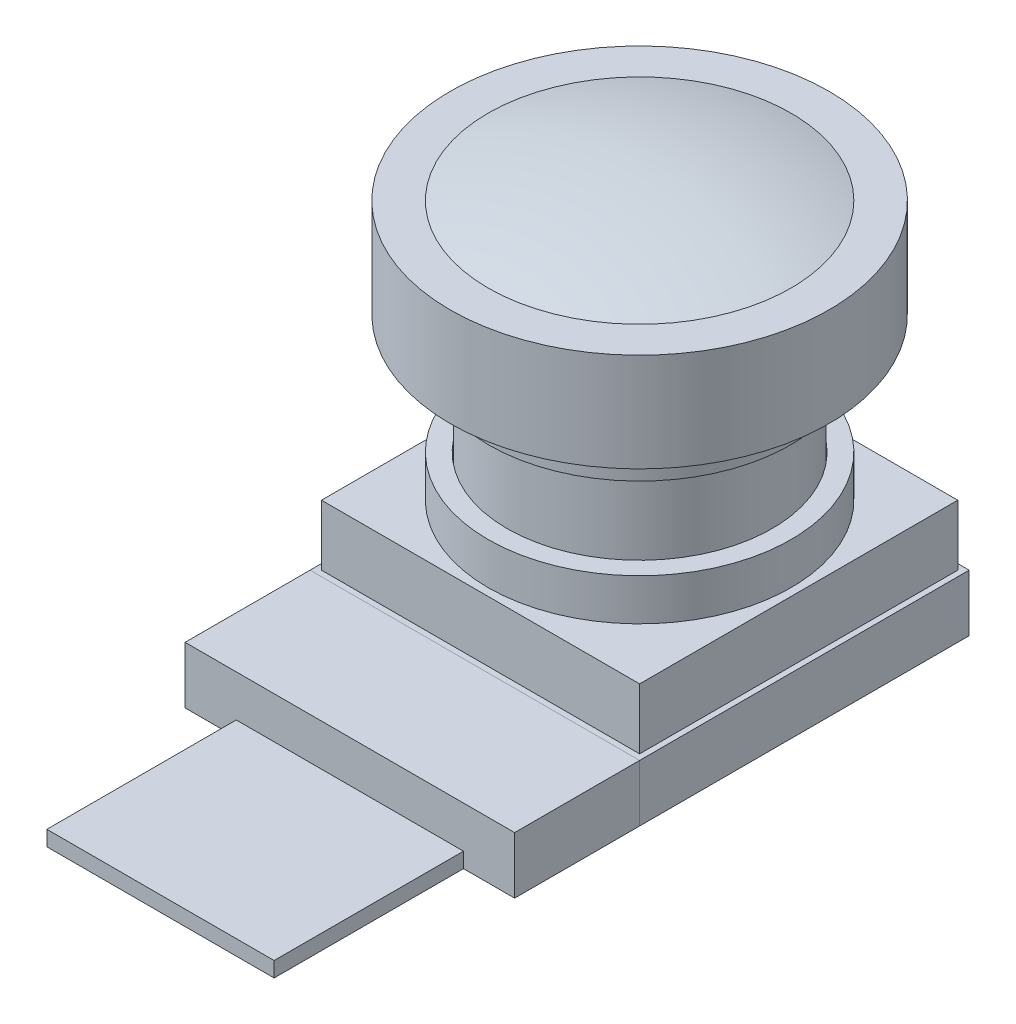
ISO-10303-21;
HEADER;
FILE_DESCRIPTION(('STEP AP214'),'2;1');
FILE_NAME('part.step','',(''),(''),'','','');
FILE_SCHEMA(('AUTOMOTIVE_DESIGN { 1 0 10303 214 1 1 1 1 }'));
ENDSEC;
DATA;
#1=APPLICATION_CONTEXT('core data for automotive mechanical design processes');
#2=APPLICATION_PROTOCOL_DEFINITION('international standard','automotive_design',2000,#1);
#3=PRODUCT_CONTEXT('',#1,'mechanical');
#4=PRODUCT('Part','Part','',(#3));
#5=PRODUCT_RELATED_PRODUCT_CATEGORY('part','',(#4));
#6=PRODUCT_DEFINITION_FORMATION('','',#4);
#7=PRODUCT_DEFINITION_CONTEXT('part definition',#1,'design');
#8=PRODUCT_DEFINITION('design','',#6,#7);
#9=PRODUCT_DEFINITION_SHAPE('','',#8);
#10=(LENGTH_UNIT() NAMED_UNIT(*) SI_UNIT(.MILLI.,.METRE.));
#11=(NAMED_UNIT(*) PLANE_ANGLE_UNIT() SI_UNIT($,.RADIAN.));
#12=(NAMED_UNIT(*) SI_UNIT($,.STERADIAN.) SOLID_ANGLE_UNIT());
#13=UNCERTAINTY_MEASURE_WITH_UNIT(LENGTH_MEASURE(1.E-05),#10,'distance_accuracy_value','');
#14=(GEOMETRIC_REPRESENTATION_CONTEXT(3) GLOBAL_UNCERTAINTY_ASSIGNED_CONTEXT((#13)) GLOBAL_UNIT_ASSIGNED_CONTEXT((#10,
#11,#12)) REPRESENTATION_CONTEXT('',''));
#15=CARTESIAN_POINT('',(0.,0.,0.));
#16=DIRECTION('',(0.,0.,1.));
#17=DIRECTION('',(1.,0.,0.));
#18=AXIS2_PLACEMENT_3D('',#15,#16,#17);
#19=CARTESIAN_POINT('',(-3.,0.4,7.65));
#20=DIRECTION('',(1.,0.,0.));
#21=DIRECTION('',(0.,0.,-1.));
#22=AXIS2_PLACEMENT_3D('',#19,#20,#21);
#23=PLANE('',#22);
#24=DIRECTION('',(0.,0.,1.));
#25=VECTOR('',#24,1.);
#26=CARTESIAN_POINT('',(-3.,0.,7.65));
#27=LINE('',#26,#25);
#28=CARTESIAN_POINT('',(-3.,0.,7.65));
#29=VERTEX_POINT('',#28);
#30=CARTESIAN_POINT('',(-3.,0.,12.65));
#31=VERTEX_POINT('',#30);
#32=EDGE_CURVE('E112',#29,#31,#27,.T.);
#33=ORIENTED_EDGE('',*,*,#32,.T.);
#34=DIRECTION('',(0.,-1.,0.));
#35=VECTOR('',#34,1.);
#36=CARTESIAN_POINT('',(-3.,0.4,12.65));
#37=LINE('',#36,#35);
#38=CARTESIAN_POINT('',(-3.,0.4,12.65));
#39=VERTEX_POINT('',#38);
#40=EDGE_CURVE('E12',#39,#31,#37,.T.);
#41=ORIENTED_EDGE('',*,*,#40,.F.);
#42=DIRECTION('',(0.,0.,1.));
#43=VECTOR('',#42,1.);
#44=CARTESIAN_POINT('',(-3.,0.4,7.65));
#45=LINE('',#44,#43);
#46=CARTESIAN_POINT('',(-3.,0.4,7.65));
#47=VERTEX_POINT('',#46);
#48=EDGE_CURVE('E100',#47,#39,#45,.T.);
#49=ORIENTED_EDGE('',*,*,#48,.F.);
#50=DIRECTION('',(0.,-1.,0.));
#51=VECTOR('',#50,1.);
#52=CARTESIAN_POINT('',(-3.,0.4,7.65));
#53=LINE('',#52,#51);
#54=EDGE_CURVE('E108',#47,#29,#53,.T.);
#55=ORIENTED_EDGE('',*,*,#54,.T.);
#56=EDGE_LOOP('',(#33,#41,#49,#55));
#57=FACE_BOUND('',#56,.T.);
#58=ADVANCED_FACE('F49',(#57),#23,.F.);
#59=CARTESIAN_POINT('',(-3.,0.4,12.65));
#60=DIRECTION('',(0.,0.,-1.));
#61=DIRECTION('',(-1.,0.,0.));
#62=AXIS2_PLACEMENT_3D('',#59,#60,#61);
#63=PLANE('',#62);
#64=DIRECTION('',(1.,0.,0.));
#65=VECTOR('',#64,1.);
#66=CARTESIAN_POINT('',(-3.,0.,12.65));
#67=LINE('',#66,#65);
#68=CARTESIAN_POINT('',(3.,0.,12.65));
#69=VERTEX_POINT('',#68);
#70=EDGE_CURVE('E104',#31,#69,#67,.T.);
#71=ORIENTED_EDGE('',*,*,#70,.T.);
#72=DIRECTION('',(0.,-1.,0.));
#73=VECTOR('',#72,1.);
#74=CARTESIAN_POINT('',(3.,0.4,12.65));
#75=LINE('',#74,#73);
#76=CARTESIAN_POINT('',(3.,0.4,12.65));
#77=VERTEX_POINT('',#76);
#78=EDGE_CURVE('E57',#77,#69,#75,.T.);
#79=ORIENTED_EDGE('',*,*,#78,.F.);
#80=DIRECTION('',(1.,0.,0.));
#81=VECTOR('',#80,1.);
#82=CARTESIAN_POINT('',(-3.,0.4,12.65));
#83=LINE('',#82,#81);
#84=EDGE_CURVE('E95',#39,#77,#83,.T.);
#85=ORIENTED_EDGE('',*,*,#84,.F.);
#86=ORIENTED_EDGE('',*,*,#40,.T.);
#87=EDGE_LOOP('',(#71,#79,#85,#86));
#88=FACE_BOUND('',#87,.T.);
#89=ADVANCED_FACE('F103',(#88),#63,.F.);
#90=CARTESIAN_POINT('',(3.,0.4,7.65));
#91=DIRECTION('',(-1.,0.,0.));
#92=DIRECTION('',(0.,0.,1.));
#93=AXIS2_PLACEMENT_3D('',#90,#91,#92);
#94=PLANE('',#93);
#95=DIRECTION('',(0.,0.,-1.));
#96=VECTOR('',#95,1.);
#97=CARTESIAN_POINT('',(3.,0.,7.65));
#98=LINE('',#97,#96);
#99=CARTESIAN_POINT('',(3.,0.,7.65));
#100=VERTEX_POINT('',#99);
#101=EDGE_CURVE('E82',#69,#100,#98,.T.);
#102=ORIENTED_EDGE('',*,*,#101,.T.);
#103=DIRECTION('',(0.,-1.,0.));
#104=VECTOR('',#103,1.);
#105=CARTESIAN_POINT('',(3.,0.4,7.65));
#106=LINE('',#105,#104);
#107=CARTESIAN_POINT('',(3.,0.4,7.65));
#108=VERTEX_POINT('',#107);
#109=EDGE_CURVE('E105',#108,#100,#106,.T.);
#110=ORIENTED_EDGE('',*,*,#109,.F.);
#111=DIRECTION('',(0.,0.,-1.));
#112=VECTOR('',#111,1.);
#113=CARTESIAN_POINT('',(3.,0.4,7.65));
#114=LINE('',#113,#112);
#115=EDGE_CURVE('E98',#77,#108,#114,.T.);
#116=ORIENTED_EDGE('',*,*,#115,.F.);
#117=ORIENTED_EDGE('',*,*,#78,.T.);
#118=EDGE_LOOP('',(#102,#110,#116,#117));
#119=FACE_BOUND('',#118,.T.);
#120=ADVANCED_FACE('F106',(#119),#94,.F.);
#121=CARTESIAN_POINT('',(-3.,0.4,7.65));
#122=DIRECTION('',(0.,0.,1.));
#123=DIRECTION('',(1.,0.,0.));
#124=AXIS2_PLACEMENT_3D('',#121,#122,#123);
#125=PLANE('',#124);
#126=DIRECTION('',(-1.,0.,0.));
#127=VECTOR('',#126,1.);
#128=CARTESIAN_POINT('',(-3.,0.,7.65));
#129=LINE('',#128,#127);
#130=EDGE_CURVE('E88',#100,#29,#129,.T.);
#131=ORIENTED_EDGE('',*,*,#130,.T.);
#132=ORIENTED_EDGE('',*,*,#54,.F.);
#133=DIRECTION('',(-1.,0.,0.));
#134=VECTOR('',#133,1.);
#135=CARTESIAN_POINT('',(-3.,0.4,7.65));
#136=LINE('',#135,#134);
#137=EDGE_CURVE('E65',#108,#47,#136,.T.);
#138=ORIENTED_EDGE('',*,*,#137,.F.);
#139=ORIENTED_EDGE('',*,*,#109,.T.);
#140=EDGE_LOOP('',(#131,#132,#138,#139));
#141=FACE_BOUND('',#140,.T.);
#142=ADVANCED_FACE('F119',(#141),#125,.F.);
#143=CARTESIAN_POINT('',(0.,0.4,0.));
#144=DIRECTION('',(0.,1.,0.));
#145=DIRECTION('',(0.,0.,1.));
#146=AXIS2_PLACEMENT_3D('',#143,#144,#145);
#147=PLANE('',#146);
#148=ORIENTED_EDGE('',*,*,#48,.T.);
#149=ORIENTED_EDGE('',*,*,#84,.T.);
#150=ORIENTED_EDGE('',*,*,#115,.T.);
#151=ORIENTED_EDGE('',*,*,#137,.T.);
#152=EDGE_LOOP('',(#148,#149,#150,#151));
#153=FACE_BOUND('',#152,.T.);
#154=ADVANCED_FACE('F96',(#153),#147,.T.);
#155=CARTESIAN_POINT('',(0.,0.,0.));
#156=DIRECTION('',(0.,1.,0.));
#157=DIRECTION('',(0.,0.,1.));
#158=AXIS2_PLACEMENT_3D('',#155,#156,#157);
#159=PLANE('',#158);
#160=ORIENTED_EDGE('',*,*,#32,.F.);
#161=ORIENTED_EDGE('',*,*,#130,.F.);
#162=ORIENTED_EDGE('',*,*,#101,.F.);
#163=ORIENTED_EDGE('',*,*,#70,.F.);
#164=EDGE_LOOP('',(#160,#161,#162,#163));
#165=FACE_BOUND('',#164,.T.);
#166=ADVANCED_FACE('F122',(#165),#159,.F.);
#167=CLOSED_SHELL('',(#58,#89,#120,#142,#154,#166));
#168=MANIFOLD_SOLID_BREP('B2',#167);
#169=CARTESIAN_POINT('',(-4.35,0.,7.65));
#170=DIRECTION('',(1.,0.,0.));
#171=DIRECTION('',(0.,0.,-1.));
#172=AXIS2_PLACEMENT_3D('',#169,#170,#171);
#173=PLANE('',#172);
#174=DIRECTION('',(0.,-1.,0.));
#175=VECTOR('',#174,1.);
#176=CARTESIAN_POINT('',(-4.35,0.,4.35));
#177=LINE('',#176,#175);
#178=CARTESIAN_POINT('',(-4.35,1.5,4.35));
#179=VERTEX_POINT('',#178);
#180=CARTESIAN_POINT('',(-4.35,0.,4.35));
#181=VERTEX_POINT('',#180);
#182=EDGE_CURVE('E247',#179,#181,#177,.T.);
#183=ORIENTED_EDGE('',*,*,#182,.T.);
#184=DIRECTION('',(0.,0.,-1.));
#185=VECTOR('',#184,1.);
#186=CARTESIAN_POINT('',(-4.35,0.,7.65));
#187=LINE('',#186,#185);
#188=CARTESIAN_POINT('',(-4.35,0.,7.65));
#189=VERTEX_POINT('',#188);
#190=EDGE_CURVE('E47',#189,#181,#187,.T.);
#191=ORIENTED_EDGE('',*,*,#190,.F.);
#192=DIRECTION('',(0.,-1.,0.));
#193=VECTOR('',#192,1.);
#194=CARTESIAN_POINT('',(-4.35,0.,7.65));
#195=LINE('',#194,#193);
#196=CARTESIAN_POINT('',(-4.35,1.5,7.65));
#197=VERTEX_POINT('',#196);
#198=EDGE_CURVE('E235',#197,#189,#195,.T.);
#199=ORIENTED_EDGE('',*,*,#198,.F.);
#200=DIRECTION('',(0.,0.,-1.));
#201=VECTOR('',#200,1.);
#202=CARTESIAN_POINT('',(-4.35,1.5,7.65));
#203=LINE('',#202,#201);
#204=EDGE_CURVE('E243',#197,#179,#203,.T.);
#205=ORIENTED_EDGE('',*,*,#204,.T.);
#206=EDGE_LOOP('',(#183,#191,#199,#205));
#207=FACE_BOUND('',#206,.T.);
#208=ADVANCED_FACE('F184',(#207),#173,.F.);
#209=CARTESIAN_POINT('',(-4.35,0.,7.65));
#210=DIRECTION('',(0.,1.,0.));
#211=DIRECTION('',(0.,0.,1.));
#212=AXIS2_PLACEMENT_3D('',#209,#210,#211);
#213=PLANE('',#212);
#214=DIRECTION('',(1.,0.,0.));
#215=VECTOR('',#214,1.);
#216=CARTESIAN_POINT('',(-4.35,0.,4.35));
#217=LINE('',#216,#215);
#218=CARTESIAN_POINT('',(4.35,0.,4.35));
#219=VERTEX_POINT('',#218);
#220=EDGE_CURVE('E239',#181,#219,#217,.T.);
#221=ORIENTED_EDGE('',*,*,#220,.T.);
#222=DIRECTION('',(0.,0.,-1.));
#223=VECTOR('',#222,1.);
#224=CARTESIAN_POINT('',(4.35,0.,7.65));
#225=LINE('',#224,#223);
#226=CARTESIAN_POINT('',(4.35,0.,7.65));
#227=VERTEX_POINT('',#226);
#228=EDGE_CURVE('E192',#227,#219,#225,.T.);
#229=ORIENTED_EDGE('',*,*,#228,.F.);
#230=DIRECTION('',(1.,0.,0.));
#231=VECTOR('',#230,1.);
#232=CARTESIAN_POINT('',(-4.35,0.,7.65));
#233=LINE('',#232,#231);
#234=EDGE_CURVE('E230',#189,#227,#233,.T.);
#235=ORIENTED_EDGE('',*,*,#234,.F.);
#236=ORIENTED_EDGE('',*,*,#190,.T.);
#237=EDGE_LOOP('',(#221,#229,#235,#236));
#238=FACE_BOUND('',#237,.T.);
#239=ADVANCED_FACE('F238',(#238),#213,.F.);
#240=CARTESIAN_POINT('',(4.35,0.,7.65));
#241=DIRECTION('',(-1.,0.,0.));
#242=DIRECTION('',(0.,0.,1.));
#243=AXIS2_PLACEMENT_3D('',#240,#241,#242);
#244=PLANE('',#243);
#245=DIRECTION('',(0.,1.,0.));
#246=VECTOR('',#245,1.);
#247=CARTESIAN_POINT('',(4.35,0.,4.35));
#248=LINE('',#247,#246);
#249=CARTESIAN_POINT('',(4.35,1.5,4.35));
#250=VERTEX_POINT('',#249);
#251=EDGE_CURVE('E217',#219,#250,#248,.T.);
#252=ORIENTED_EDGE('',*,*,#251,.T.);
#253=DIRECTION('',(0.,0.,-1.));
#254=VECTOR('',#253,1.);
#255=CARTESIAN_POINT('',(4.35,1.5,7.65));
#256=LINE('',#255,#254);
#257=CARTESIAN_POINT('',(4.35,1.5,7.65));
#258=VERTEX_POINT('',#257);
#259=EDGE_CURVE('E240',#258,#250,#256,.T.);
#260=ORIENTED_EDGE('',*,*,#259,.F.);
#261=DIRECTION('',(0.,1.,0.));
#262=VECTOR('',#261,1.);
#263=CARTESIAN_POINT('',(4.35,0.,7.65));
#264=LINE('',#263,#262);
#265=EDGE_CURVE('E233',#227,#258,#264,.T.);
#266=ORIENTED_EDGE('',*,*,#265,.F.);
#267=ORIENTED_EDGE('',*,*,#228,.T.);
#268=EDGE_LOOP('',(#252,#260,#266,#267));
#269=FACE_BOUND('',#268,.T.);
#270=ADVANCED_FACE('F241',(#269),#244,.F.);
#271=CARTESIAN_POINT('',(-4.35,1.5,7.65));
#272=DIRECTION('',(0.,-1.,0.));
#273=DIRECTION('',(0.,0.,-1.));
#274=AXIS2_PLACEMENT_3D('',#271,#272,#273);
#275=PLANE('',#274);
#276=DIRECTION('',(-1.,0.,0.));
#277=VECTOR('',#276,1.);
#278=CARTESIAN_POINT('',(-4.35,1.5,4.35));
#279=LINE('',#278,#277);
#280=EDGE_CURVE('E223',#250,#179,#279,.T.);
#281=ORIENTED_EDGE('',*,*,#280,.T.);
#282=ORIENTED_EDGE('',*,*,#204,.F.);
#283=DIRECTION('',(-1.,0.,0.));
#284=VECTOR('',#283,1.);
#285=CARTESIAN_POINT('',(-4.35,1.5,7.65));
#286=LINE('',#285,#284);
#287=EDGE_CURVE('E200',#258,#197,#286,.T.);
#288=ORIENTED_EDGE('',*,*,#287,.F.);
#289=ORIENTED_EDGE('',*,*,#259,.T.);
#290=EDGE_LOOP('',(#281,#282,#288,#289));
#291=FACE_BOUND('',#290,.T.);
#292=ADVANCED_FACE('F254',(#291),#275,.F.);
#293=CARTESIAN_POINT('',(0.,0.,7.65));
#294=DIRECTION('',(0.,0.,-1.));
#295=DIRECTION('',(-1.,0.,0.));
#296=AXIS2_PLACEMENT_3D('',#293,#294,#295);
#297=PLANE('',#296);
#298=ORIENTED_EDGE('',*,*,#198,.T.);
#299=ORIENTED_EDGE('',*,*,#234,.T.);
#300=ORIENTED_EDGE('',*,*,#265,.T.);
#301=ORIENTED_EDGE('',*,*,#287,.T.);
#302=EDGE_LOOP('',(#298,#299,#300,#301));
#303=FACE_BOUND('',#302,.T.);
#304=ADVANCED_FACE('F231',(#303),#297,.F.);
#305=CARTESIAN_POINT('',(0.,0.,4.35));
#306=DIRECTION('',(0.,0.,-1.));
#307=DIRECTION('',(-1.,0.,0.));
#308=AXIS2_PLACEMENT_3D('',#305,#306,#307);
#309=PLANE('',#308);
#310=ORIENTED_EDGE('',*,*,#182,.F.);
#311=ORIENTED_EDGE('',*,*,#280,.F.);
#312=ORIENTED_EDGE('',*,*,#251,.F.);
#313=ORIENTED_EDGE('',*,*,#220,.F.);
#314=EDGE_LOOP('',(#310,#311,#312,#313));
#315=FACE_BOUND('',#314,.T.);
#316=ADVANCED_FACE('F257',(#315),#309,.T.);
#317=CLOSED_SHELL('',(#208,#239,#270,#292,#304,#316));
#318=MANIFOLD_SOLID_BREP('B6',#317);
#319=CARTESIAN_POINT('',(0.,3.1,0.));
#320=DIRECTION('',(0.,1.,0.));
#321=DIRECTION('',(0.,0.,1.));
#322=AXIS2_PLACEMENT_3D('',#319,#320,#321);
#323=PLANE('',#322);
#324=CARTESIAN_POINT('',(0.,3.1,0.));
#325=DIRECTION('',(0.,1.,0.));
#326=DIRECTION('',(0.,0.,1.));
#327=AXIS2_PLACEMENT_3D('',#324,#325,#326);
#328=CIRCLE('',#327,4.);
#329=CARTESIAN_POINT('',(0.,3.1,4.));
#330=VERTEX_POINT('',#329);
#331=EDGE_CURVE('E465',#330,#330,#328,.T.);
#332=ORIENTED_EDGE('',*,*,#331,.F.);
#333=EDGE_LOOP('',(#332));
#334=FACE_BOUND('',#333,.T.);
#335=DIRECTION('',(1.,0.,0.));
#336=VECTOR('',#335,1.);
#337=CARTESIAN_POINT('',(-4.2,3.1,4.2));
#338=LINE('',#337,#336);
#339=CARTESIAN_POINT('',(-4.2,3.1,4.2));
#340=VERTEX_POINT('',#339);
#341=CARTESIAN_POINT('',(4.2,3.1,4.2));
#342=VERTEX_POINT('',#341);
#343=EDGE_CURVE('E562',#340,#342,#338,.T.);
#344=ORIENTED_EDGE('',*,*,#343,.T.);
#345=DIRECTION('',(0.,0.,-1.));
#346=VECTOR('',#345,1.);
#347=CARTESIAN_POINT('',(4.2,3.1,-4.2));
#348=LINE('',#347,#346);
#349=CARTESIAN_POINT('',(4.2,3.1,-4.2));
#350=VERTEX_POINT('',#349);
#351=EDGE_CURVE('E560',#342,#350,#348,.T.);
#352=ORIENTED_EDGE('',*,*,#351,.T.);
#353=DIRECTION('',(-1.,0.,0.));
#354=VECTOR('',#353,1.);
#355=CARTESIAN_POINT('',(-4.2,3.1,-4.2));
#356=LINE('',#355,#354);
#357=CARTESIAN_POINT('',(-4.2,3.1,-4.2));
#358=VERTEX_POINT('',#357);
#359=EDGE_CURVE('E543',#350,#358,#356,.T.);
#360=ORIENTED_EDGE('',*,*,#359,.T.);
#361=DIRECTION('',(0.,0.,1.));
#362=VECTOR('',#361,1.);
#363=CARTESIAN_POINT('',(-4.2,3.1,-4.2));
#364=LINE('',#363,#362);
#365=EDGE_CURVE('E334',#358,#340,#364,.T.);
#366=ORIENTED_EDGE('',*,*,#365,.T.);
#367=EDGE_LOOP('',(#344,#352,#360,#366));
#368=FACE_BOUND('',#367,.T.);
#369=ADVANCED_FACE('F311',(#334,#368),#323,.T.);
#370=CARTESIAN_POINT('',(0.,29.7429263941167,0.));
#371=DIRECTION('',(0.,-1.,0.));
#372=DIRECTION('',(0.,0.,-1.));
#373=AXIS2_PLACEMENT_3D('',#370,#371,#372);
#374=CYLINDRICAL_SURFACE('',#373,3.48);
#375=CARTESIAN_POINT('',(0.,6.35,0.));
#376=DIRECTION('',(0.,-1.,0.));
#377=DIRECTION('',(0.,0.,-1.));
#378=AXIS2_PLACEMENT_3D('',#375,#376,#377);
#379=CIRCLE('',#378,3.48);
#380=CARTESIAN_POINT('',(0.,6.35,-3.48));
#381=VERTEX_POINT('',#380);
#382=EDGE_CURVE('E574',#381,#381,#379,.T.);
#383=ORIENTED_EDGE('',*,*,#382,.T.);
#384=EDGE_LOOP('',(#383));
#385=FACE_BOUND('',#384,.T.);
#386=CARTESIAN_POINT('',(0.,3.1,0.));
#387=DIRECTION('',(0.,1.,0.));
#388=DIRECTION('',(0.,0.,1.));
#389=AXIS2_PLACEMENT_3D('',#386,#387,#388);
#390=CIRCLE('',#389,3.48);
#391=CARTESIAN_POINT('',(0.,3.1,3.48));
#392=VERTEX_POINT('',#391);
#393=EDGE_CURVE('E457',#392,#392,#390,.T.);
#394=ORIENTED_EDGE('',*,*,#393,.T.);
#395=EDGE_LOOP('',(#394));
#396=FACE_BOUND('',#395,.T.);
#397=ADVANCED_FACE('F426',(#385,#396),#374,.T.);
#398=CARTESIAN_POINT('',(0.,4.2,0.));
#399=DIRECTION('',(0.,1.,0.));
#400=DIRECTION('',(0.,0.,1.));
#401=AXIS2_PLACEMENT_3D('',#398,#399,#400);
#402=PLANE('',#401);
#403=CARTESIAN_POINT('',(0.,4.2,0.));
#404=DIRECTION('',(0.,1.,0.));
#405=DIRECTION('',(0.,0.,1.));
#406=AXIS2_PLACEMENT_3D('',#403,#404,#405);
#407=CIRCLE('',#406,4.);
#408=CARTESIAN_POINT('',(0.,4.2,4.));
#409=VERTEX_POINT('',#408);
#410=EDGE_CURVE('E472',#409,#409,#407,.T.);
#411=ORIENTED_EDGE('',*,*,#410,.T.);
#412=EDGE_LOOP('',(#411));
#413=FACE_BOUND('',#412,.T.);
#414=CARTESIAN_POINT('',(0.,4.2,0.));
#415=DIRECTION('',(0.,1.,0.));
#416=DIRECTION('',(0.,0.,1.));
#417=AXIS2_PLACEMENT_3D('',#414,#415,#416);
#418=CIRCLE('',#417,3.5);
#419=CARTESIAN_POINT('',(0.,4.2,3.5));
#420=VERTEX_POINT('',#419);
#421=EDGE_CURVE('E461',#420,#420,#418,.T.);
#422=ORIENTED_EDGE('',*,*,#421,.F.);
#423=EDGE_LOOP('',(#422));
#424=FACE_BOUND('',#423,.T.);
#425=ADVANCED_FACE('F433',(#413,#424),#402,.T.);
#426=CARTESIAN_POINT('',(0.,4.2,0.));
#427=DIRECTION('',(0.,-1.,0.));
#428=DIRECTION('',(0.,0.,-1.));
#429=AXIS2_PLACEMENT_3D('',#426,#427,#428);
#430=CYLINDRICAL_SURFACE('',#429,4.);
#431=ORIENTED_EDGE('',*,*,#410,.F.);
#432=EDGE_LOOP('',(#431));
#433=FACE_BOUND('',#432,.T.);
#434=ORIENTED_EDGE('',*,*,#331,.T.);
#435=EDGE_LOOP('',(#434));
#436=FACE_BOUND('',#435,.T.);
#437=ADVANCED_FACE('F451',(#433,#436),#430,.T.);
#438=CARTESIAN_POINT('',(0.,4.2,0.));
#439=DIRECTION('',(0.,-1.,0.));
#440=DIRECTION('',(0.,0.,-1.));
#441=AXIS2_PLACEMENT_3D('',#438,#439,#440);
#442=CYLINDRICAL_SURFACE('',#441,3.5);
#443=ORIENTED_EDGE('',*,*,#421,.T.);
#444=EDGE_LOOP('',(#443));
#445=FACE_BOUND('',#444,.T.);
#446=CARTESIAN_POINT('',(0.,3.1,0.));
#447=DIRECTION('',(0.,1.,0.));
#448=DIRECTION('',(0.,0.,1.));
#449=AXIS2_PLACEMENT_3D('',#446,#447,#448);
#450=CIRCLE('',#449,3.5);
#451=CARTESIAN_POINT('',(0.,3.1,3.5));
#452=VERTEX_POINT('',#451);
#453=EDGE_CURVE('E396',#452,#452,#450,.F.);
#454=ORIENTED_EDGE('',*,*,#453,.T.);
#455=EDGE_LOOP('',(#454));
#456=FACE_BOUND('',#455,.T.);
#457=ADVANCED_FACE('F442',(#445,#456),#442,.F.);
#458=ORIENTED_EDGE('',*,*,#393,.F.);
#459=EDGE_LOOP('',(#458));
#460=FACE_BOUND('',#459,.T.);
#461=ORIENTED_EDGE('',*,*,#453,.F.);
#462=EDGE_LOOP('',(#461));
#463=FACE_BOUND('',#462,.T.);
#464=ADVANCED_FACE('F429',(#460,#463),#323,.T.);
#465=CARTESIAN_POINT('',(4.2,-10.8036579926459,-4.2));
#466=DIRECTION('',(1.,0.,0.));
#467=DIRECTION('',(0.,0.,-1.));
#468=AXIS2_PLACEMENT_3D('',#465,#466,#467);
#469=PLANE('',#468);
#470=DIRECTION('',(0.,0.,-1.));
#471=VECTOR('',#470,1.);
#472=CARTESIAN_POINT('',(4.2,1.5,-4.2));
#473=LINE('',#472,#471);
#474=CARTESIAN_POINT('',(4.2,1.5,4.2));
#475=VERTEX_POINT('',#474);
#476=CARTESIAN_POINT('',(4.2,1.5,-4.2));
#477=VERTEX_POINT('',#476);
#478=EDGE_CURVE('E542',#475,#477,#473,.T.);
#479=ORIENTED_EDGE('',*,*,#478,.T.);
#480=DIRECTION('',(0.,1.,0.));
#481=VECTOR('',#480,1.);
#482=CARTESIAN_POINT('',(4.2,-10.8036579926459,-4.2));
#483=LINE('',#482,#481);
#484=EDGE_CURVE('E549',#477,#350,#483,.T.);
#485=ORIENTED_EDGE('',*,*,#484,.T.);
#486=ORIENTED_EDGE('',*,*,#351,.F.);
#487=DIRECTION('',(0.,1.,0.));
#488=VECTOR('',#487,1.);
#489=CARTESIAN_POINT('',(4.2,-10.8036579926459,4.2));
#490=LINE('',#489,#488);
#491=EDGE_CURVE('E383',#475,#342,#490,.T.);
#492=ORIENTED_EDGE('',*,*,#491,.F.);
#493=EDGE_LOOP('',(#479,#485,#486,#492));
#494=FACE_BOUND('',#493,.T.);
#495=ADVANCED_FACE('F441',(#494),#469,.T.);
#496=CARTESIAN_POINT('',(-4.2,-10.8036579926459,4.2));
#497=DIRECTION('',(0.,0.,1.));
#498=DIRECTION('',(1.,0.,0.));
#499=AXIS2_PLACEMENT_3D('',#496,#497,#498);
#500=PLANE('',#499);
#501=DIRECTION('',(1.,0.,0.));
#502=VECTOR('',#501,1.);
#503=CARTESIAN_POINT('',(-4.2,1.5,4.2));
#504=LINE('',#503,#502);
#505=CARTESIAN_POINT('',(-4.2,1.5,4.2));
#506=VERTEX_POINT('',#505);
#507=EDGE_CURVE('E535',#506,#475,#504,.T.);
#508=ORIENTED_EDGE('',*,*,#507,.T.);
#509=ORIENTED_EDGE('',*,*,#491,.T.);
#510=ORIENTED_EDGE('',*,*,#343,.F.);
#511=DIRECTION('',(0.,1.,0.));
#512=VECTOR('',#511,1.);
#513=CARTESIAN_POINT('',(-4.2,-10.8036579926459,4.2));
#514=LINE('',#513,#512);
#515=EDGE_CURVE('E539',#506,#340,#514,.T.);
#516=ORIENTED_EDGE('',*,*,#515,.F.);
#517=EDGE_LOOP('',(#508,#509,#510,#516));
#518=FACE_BOUND('',#517,.T.);
#519=ADVANCED_FACE('F448',(#518),#500,.T.);
#520=CARTESIAN_POINT('',(-4.2,-10.8036579926459,-4.2));
#521=DIRECTION('',(-1.,0.,0.));
#522=DIRECTION('',(0.,0.,1.));
#523=AXIS2_PLACEMENT_3D('',#520,#521,#522);
#524=PLANE('',#523);
#525=DIRECTION('',(0.,0.,1.));
#526=VECTOR('',#525,1.);
#527=CARTESIAN_POINT('',(-4.2,1.5,-4.2));
#528=LINE('',#527,#526);
#529=CARTESIAN_POINT('',(-4.2,1.5,-4.2));
#530=VERTEX_POINT('',#529);
#531=EDGE_CURVE('E552',#530,#506,#528,.T.);
#532=ORIENTED_EDGE('',*,*,#531,.T.);
#533=ORIENTED_EDGE('',*,*,#515,.T.);
#534=ORIENTED_EDGE('',*,*,#365,.F.);
#535=DIRECTION('',(0.,1.,0.));
#536=VECTOR('',#535,1.);
#537=CARTESIAN_POINT('',(-4.2,-10.8036579926459,-4.2));
#538=LINE('',#537,#536);
#539=EDGE_CURVE('E563',#530,#358,#538,.T.);
#540=ORIENTED_EDGE('',*,*,#539,.F.);
#541=EDGE_LOOP('',(#532,#533,#534,#540));
#542=FACE_BOUND('',#541,.T.);
#543=ADVANCED_FACE('F525',(#542),#524,.T.);
#544=CARTESIAN_POINT('',(-4.2,-10.8036579926459,-4.2));
#545=DIRECTION('',(0.,0.,-1.));
#546=DIRECTION('',(-1.,0.,0.));
#547=AXIS2_PLACEMENT_3D('',#544,#545,#546);
#548=PLANE('',#547);
#549=DIRECTION('',(-1.,0.,0.));
#550=VECTOR('',#549,1.);
#551=CARTESIAN_POINT('',(-4.2,1.5,-4.2));
#552=LINE('',#551,#550);
#553=EDGE_CURVE('E546',#477,#530,#552,.T.);
#554=ORIENTED_EDGE('',*,*,#553,.T.);
#555=ORIENTED_EDGE('',*,*,#539,.T.);
#556=ORIENTED_EDGE('',*,*,#359,.F.);
#557=ORIENTED_EDGE('',*,*,#484,.F.);
#558=EDGE_LOOP('',(#554,#555,#556,#557));
#559=FACE_BOUND('',#558,.T.);
#560=ADVANCED_FACE('F502',(#559),#548,.T.);
#561=CARTESIAN_POINT('',(-4.35,1.5,7.65));
#562=DIRECTION('',(0.,-1.,0.));
#563=DIRECTION('',(0.,0.,-1.));
#564=AXIS2_PLACEMENT_3D('',#561,#562,#563);
#565=PLANE('',#564);
#566=DIRECTION('',(1.,0.,0.));
#567=VECTOR('',#566,1.);
#568=CARTESIAN_POINT('',(-4.35,1.5,4.35));
#569=LINE('',#568,#567);
#570=CARTESIAN_POINT('',(-4.35,1.5,4.35));
#571=VERTEX_POINT('',#570);
#572=CARTESIAN_POINT('',(4.35,1.5,4.35));
#573=VERTEX_POINT('',#572);
#574=EDGE_CURVE('E379',#571,#573,#569,.T.);
#575=ORIENTED_EDGE('',*,*,#574,.T.);
#576=DIRECTION('',(0.,0.,-1.));
#577=VECTOR('',#576,1.);
#578=CARTESIAN_POINT('',(4.35,1.5,4.35));
#579=LINE('',#578,#577);
#580=CARTESIAN_POINT('',(4.35,1.5,-4.35));
#581=VERTEX_POINT('',#580);
#582=EDGE_CURVE('E374',#573,#581,#579,.T.);
#583=ORIENTED_EDGE('',*,*,#582,.T.);
#584=DIRECTION('',(-1.,0.,0.));
#585=VECTOR('',#584,1.);
#586=CARTESIAN_POINT('',(4.35,1.5,-4.35));
#587=LINE('',#586,#585);
#588=CARTESIAN_POINT('',(-4.35,1.5,-4.35));
#589=VERTEX_POINT('',#588);
#590=EDGE_CURVE('E378',#581,#589,#587,.T.);
#591=ORIENTED_EDGE('',*,*,#590,.T.);
#592=DIRECTION('',(0.,0.,1.));
#593=VECTOR('',#592,1.);
#594=CARTESIAN_POINT('',(-4.35,1.5,-4.35));
#595=LINE('',#594,#593);
#596=EDGE_CURVE('E326',#589,#571,#595,.T.);
#597=ORIENTED_EDGE('',*,*,#596,.T.);
#598=EDGE_LOOP('',(#575,#583,#591,#597));
#599=FACE_BOUND('',#598,.T.);
#600=ORIENTED_EDGE('',*,*,#507,.F.);
#601=ORIENTED_EDGE('',*,*,#531,.F.);
#602=ORIENTED_EDGE('',*,*,#553,.F.);
#603=ORIENTED_EDGE('',*,*,#478,.F.);
#604=EDGE_LOOP('',(#600,#601,#602,#603));
#605=FACE_BOUND('',#604,.T.);
#606=ADVANCED_FACE('F376',(#599,#605),#565,.F.);
#607=CARTESIAN_POINT('',(0.,0.,0.));
#608=DIRECTION('',(0.,1.,0.));
#609=DIRECTION('',(0.,0.,1.));
#610=AXIS2_PLACEMENT_3D('',#607,#608,#609);
#611=PLANE('',#610);
#612=DIRECTION('',(0.,0.,-1.));
#613=VECTOR('',#612,1.);
#614=CARTESIAN_POINT('',(4.35,0.,-4.35));
#615=LINE('',#614,#613);
#616=CARTESIAN_POINT('',(4.35,0.,4.35));
#617=VERTEX_POINT('',#616);
#618=CARTESIAN_POINT('',(4.35,0.,-4.35));
#619=VERTEX_POINT('',#618);
#620=EDGE_CURVE('E395',#617,#619,#615,.T.);
#621=ORIENTED_EDGE('',*,*,#620,.F.);
#622=DIRECTION('',(1.,0.,0.));
#623=VECTOR('',#622,1.);
#624=CARTESIAN_POINT('',(-4.35,0.,4.35));
#625=LINE('',#624,#623);
#626=CARTESIAN_POINT('',(-4.35,0.,4.35));
#627=VERTEX_POINT('',#626);
#628=EDGE_CURVE('E483',#627,#617,#625,.T.);
#629=ORIENTED_EDGE('',*,*,#628,.F.);
#630=DIRECTION('',(0.,0.,1.));
#631=VECTOR('',#630,1.);
#632=CARTESIAN_POINT('',(-4.35,0.,-4.35));
#633=LINE('',#632,#631);
#634=CARTESIAN_POINT('',(-4.35,0.,-4.35));
#635=VERTEX_POINT('',#634);
#636=EDGE_CURVE('E480',#635,#627,#633,.T.);
#637=ORIENTED_EDGE('',*,*,#636,.F.);
#638=DIRECTION('',(-1.,0.,0.));
#639=VECTOR('',#638,1.);
#640=CARTESIAN_POINT('',(-4.35,0.,-4.35));
#641=LINE('',#640,#639);
#642=EDGE_CURVE('E478',#619,#635,#641,.T.);
#643=ORIENTED_EDGE('',*,*,#642,.F.);
#644=EDGE_LOOP('',(#621,#629,#637,#643));
#645=FACE_BOUND('',#644,.T.);
#646=ADVANCED_FACE('F495',(#645),#611,.F.);
#647=CARTESIAN_POINT('',(-4.35,3.1,4.35));
#648=DIRECTION('',(0.,0.,-1.));
#649=DIRECTION('',(-1.,0.,0.));
#650=AXIS2_PLACEMENT_3D('',#647,#648,#649);
#651=PLANE('',#650);
#652=DIRECTION('',(0.,-1.,0.));
#653=VECTOR('',#652,1.);
#654=CARTESIAN_POINT('',(4.35,3.1,4.35));
#655=LINE('',#654,#653);
#656=EDGE_CURVE('E486',#573,#617,#655,.T.);
#657=ORIENTED_EDGE('',*,*,#656,.F.);
#658=ORIENTED_EDGE('',*,*,#574,.F.);
#659=DIRECTION('',(0.,-1.,0.));
#660=VECTOR('',#659,1.);
#661=CARTESIAN_POINT('',(-4.35,3.1,4.35));
#662=LINE('',#661,#660);
#663=EDGE_CURVE('E400',#571,#627,#662,.T.);
#664=ORIENTED_EDGE('',*,*,#663,.T.);
#665=ORIENTED_EDGE('',*,*,#628,.T.);
#666=EDGE_LOOP('',(#657,#658,#664,#665));
#667=FACE_BOUND('',#666,.T.);
#668=ADVANCED_FACE('F489',(#667),#651,.F.);
#669=CARTESIAN_POINT('',(-4.35,3.1,-4.35));
#670=DIRECTION('',(1.,0.,0.));
#671=DIRECTION('',(0.,0.,-1.));
#672=AXIS2_PLACEMENT_3D('',#669,#670,#671);
#673=PLANE('',#672);
#674=ORIENTED_EDGE('',*,*,#663,.F.);
#675=ORIENTED_EDGE('',*,*,#596,.F.);
#676=DIRECTION('',(0.,-1.,0.));
#677=VECTOR('',#676,1.);
#678=CARTESIAN_POINT('',(-4.35,3.1,-4.35));
#679=LINE('',#678,#677);
#680=EDGE_CURVE('E391',#589,#635,#679,.T.);
#681=ORIENTED_EDGE('',*,*,#680,.T.);
#682=ORIENTED_EDGE('',*,*,#636,.T.);
#683=EDGE_LOOP('',(#674,#675,#681,#682));
#684=FACE_BOUND('',#683,.T.);
#685=ADVANCED_FACE('F493',(#684),#673,.F.);
#686=CARTESIAN_POINT('',(-4.35,3.1,-4.35));
#687=DIRECTION('',(0.,0.,1.));
#688=DIRECTION('',(1.,0.,0.));
#689=AXIS2_PLACEMENT_3D('',#686,#687,#688);
#690=PLANE('',#689);
#691=ORIENTED_EDGE('',*,*,#680,.F.);
#692=ORIENTED_EDGE('',*,*,#590,.F.);
#693=DIRECTION('',(0.,-1.,0.));
#694=VECTOR('',#693,1.);
#695=CARTESIAN_POINT('',(4.35,3.1,-4.35));
#696=LINE('',#695,#694);
#697=EDGE_CURVE('E389',#581,#619,#696,.T.);
#698=ORIENTED_EDGE('',*,*,#697,.T.);
#699=ORIENTED_EDGE('',*,*,#642,.T.);
#700=EDGE_LOOP('',(#691,#692,#698,#699));
#701=FACE_BOUND('',#700,.T.);
#702=ADVANCED_FACE('F387',(#701),#690,.F.);
#703=CARTESIAN_POINT('',(4.35,3.1,-4.35));
#704=DIRECTION('',(-1.,0.,0.));
#705=DIRECTION('',(0.,0.,1.));
#706=AXIS2_PLACEMENT_3D('',#703,#704,#705);
#707=PLANE('',#706);
#708=ORIENTED_EDGE('',*,*,#697,.F.);
#709=ORIENTED_EDGE('',*,*,#582,.F.);
#710=ORIENTED_EDGE('',*,*,#656,.T.);
#711=ORIENTED_EDGE('',*,*,#620,.T.);
#712=EDGE_LOOP('',(#708,#709,#710,#711));
#713=FACE_BOUND('',#712,.T.);
#714=ADVANCED_FACE('F313',(#713),#707,.F.);
#715=CARTESIAN_POINT('',(0.,6.35,0.));
#716=DIRECTION('',(0.,-1.,0.));
#717=DIRECTION('',(0.,0.,-1.));
#718=AXIS2_PLACEMENT_3D('',#715,#716,#717);
#719=PLANE('',#718);
#720=CARTESIAN_POINT('',(0.,6.35,0.));
#721=DIRECTION('',(0.,-1.,0.));
#722=DIRECTION('',(0.,0.,-1.));
#723=AXIS2_PLACEMENT_3D('',#720,#721,#722);
#724=CIRCLE('',#723,3.98);
#725=CARTESIAN_POINT('',(0.,6.35,-3.98));
#726=VERTEX_POINT('',#725);
#727=EDGE_CURVE('E555',#726,#726,#724,.T.);
#728=ORIENTED_EDGE('',*,*,#727,.T.);
#729=EDGE_LOOP('',(#728));
#730=FACE_BOUND('',#729,.T.);
#731=ORIENTED_EDGE('',*,*,#382,.F.);
#732=EDGE_LOOP('',(#731));
#733=FACE_BOUND('',#732,.T.);
#734=ADVANCED_FACE('F509',(#730,#733),#719,.T.);
#735=CARTESIAN_POINT('',(0.,6.35,0.));
#736=DIRECTION('',(0.,1.,0.));
#737=DIRECTION('',(0.,0.,1.));
#738=AXIS2_PLACEMENT_3D('',#735,#736,#737);
#739=CYLINDRICAL_SURFACE('',#738,3.98);
#740=ORIENTED_EDGE('',*,*,#727,.F.);
#741=EDGE_LOOP('',(#740));
#742=FACE_BOUND('',#741,.T.);
#743=CARTESIAN_POINT('',(0.,7.35,0.));
#744=DIRECTION('',(0.,1.,0.));
#745=DIRECTION('',(0.,0.,1.));
#746=AXIS2_PLACEMENT_3D('',#743,#744,#745);
#747=CIRCLE('',#746,3.98);
#748=CARTESIAN_POINT('',(0.,7.35,3.98));
#749=VERTEX_POINT('',#748);
#750=EDGE_CURVE('E319',#749,#749,#747,.F.);
#751=ORIENTED_EDGE('',*,*,#750,.T.);
#752=EDGE_LOOP('',(#751));
#753=FACE_BOUND('',#752,.T.);
#754=ADVANCED_FACE('F406',(#742,#753),#739,.T.);
#755=CARTESIAN_POINT('',(0.,9.95,0.));
#756=DIRECTION('',(0.,1.,0.));
#757=DIRECTION('',(0.,0.,1.));
#758=AXIS2_PLACEMENT_3D('',#755,#756,#757);
#759=PLANE('',#758);
#760=CARTESIAN_POINT('',(0.,9.95,0.));
#761=DIRECTION('',(0.,1.,0.));
#762=DIRECTION('',(0.,0.,1.));
#763=AXIS2_PLACEMENT_3D('',#760,#761,#762);
#764=CIRCLE('',#763,4.);
#765=CARTESIAN_POINT('',(0.,9.95,4.));
#766=VERTEX_POINT('',#765);
#767=EDGE_CURVE('E182',#766,#766,#764,.T.);
#768=ORIENTED_EDGE('',*,*,#767,.F.);
#769=EDGE_LOOP('',(#768));
#770=FACE_BOUND('',#769,.T.);
#771=CARTESIAN_POINT('',(0.,9.95,0.));
#772=DIRECTION('',(0.,1.,0.));
#773=DIRECTION('',(0.,0.,1.));
#774=AXIS2_PLACEMENT_3D('',#771,#772,#773);
#775=CIRCLE('',#774,5.);
#776=CARTESIAN_POINT('',(0.,9.95,5.));
#777=VERTEX_POINT('',#776);
#778=EDGE_CURVE('E468',#777,#777,#775,.T.);
#779=ORIENTED_EDGE('',*,*,#778,.T.);
#780=EDGE_LOOP('',(#779));
#781=FACE_BOUND('',#780,.T.);
#782=ADVANCED_FACE('F420',(#770,#781),#759,.T.);
#783=CARTESIAN_POINT('',(0.,7.35,0.));
#784=DIRECTION('',(0.,1.,0.));
#785=DIRECTION('',(0.,0.,1.));
#786=AXIS2_PLACEMENT_3D('',#783,#784,#785);
#787=CYLINDRICAL_SURFACE('',#786,5.);
#788=CARTESIAN_POINT('',(0.,7.35,0.));
#789=DIRECTION('',(0.,1.,0.));
#790=DIRECTION('',(0.,0.,1.));
#791=AXIS2_PLACEMENT_3D('',#788,#789,#790);
#792=CIRCLE('',#791,5.);
#793=CARTESIAN_POINT('',(0.,7.35,5.));
#794=VERTEX_POINT('',#793);
#795=EDGE_CURVE('E462',#794,#794,#792,.T.);
#796=ORIENTED_EDGE('',*,*,#795,.T.);
#797=EDGE_LOOP('',(#796));
#798=FACE_BOUND('',#797,.T.);
#799=ORIENTED_EDGE('',*,*,#778,.F.);
#800=EDGE_LOOP('',(#799));
#801=FACE_BOUND('',#800,.T.);
#802=ADVANCED_FACE('F411',(#798,#801),#787,.T.);
#803=CARTESIAN_POINT('',(0.,7.35,0.));
#804=DIRECTION('',(0.,1.,0.));
#805=DIRECTION('',(0.,0.,1.));
#806=AXIS2_PLACEMENT_3D('',#803,#804,#805);
#807=PLANE('',#806);
#808=ORIENTED_EDGE('',*,*,#795,.F.);
#809=EDGE_LOOP('',(#808));
#810=FACE_BOUND('',#809,.T.);
#811=ORIENTED_EDGE('',*,*,#750,.F.);
#812=EDGE_LOOP('',(#811));
#813=FACE_BOUND('',#812,.T.);
#814=ADVANCED_FACE('F408',(#810,#813),#807,.F.);
#815=CARTESIAN_POINT('',(0.,-3.08333333333334,0.));
#816=DIRECTION('',(0.,1.,0.));
#817=DIRECTION('',(-1.,0.,0.));
#818=AXIS2_PLACEMENT_3D('',#815,#816,#817);
#819=SPHERICAL_SURFACE('',#818,13.6333333333333);
#820=ORIENTED_EDGE('',*,*,#767,.T.);
#821=EDGE_LOOP('',(#820));
#822=FACE_BOUND('',#821,.T.);
#823=ADVANCED_FACE('F410',(#822),#819,.T.);
#824=CLOSED_SHELL('',(#369,#397,#425,#437,#457,#464,#495,#519,#543,#560,#606,#646,#668,#685,
#702,#714,#734,#754,#782,#802,#814,#823));
#825=MANIFOLD_SOLID_BREP('B41',#824);
#826=ADVANCED_BREP_SHAPE_REPRESENTATION('',(#18,#168,#318,#825),#14);
#827=SHAPE_DEFINITION_REPRESENTATION(#9,#826);
ENDSEC;
END-ISO-10303-21;
